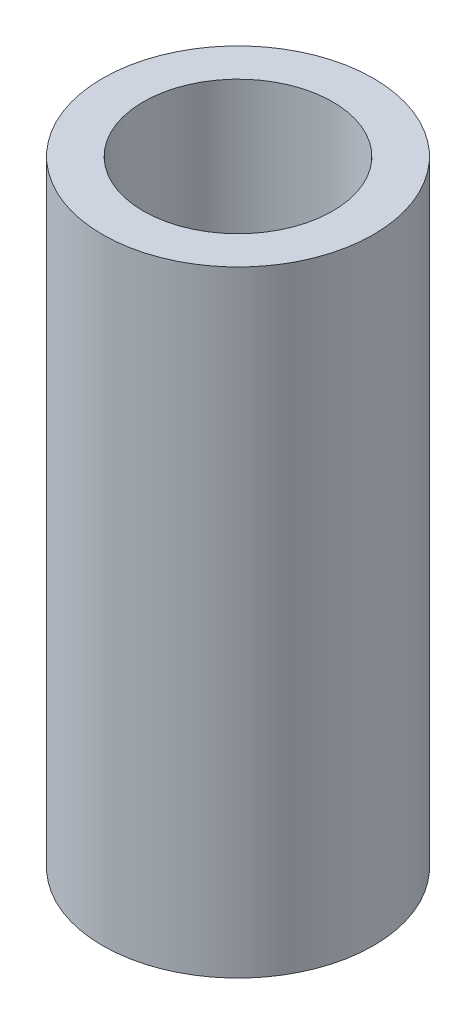
ISO-10303-21;
HEADER;
FILE_DESCRIPTION(('STEP AP214'),'2;1');
FILE_NAME('part.step','',(''),(''),'','','');
FILE_SCHEMA(('AUTOMOTIVE_DESIGN { 1 0 10303 214 1 1 1 1 }'));
ENDSEC;
DATA;
#1=APPLICATION_CONTEXT('core data for automotive mechanical design processes');
#2=APPLICATION_PROTOCOL_DEFINITION('international standard','automotive_design',2000,#1);
#3=PRODUCT_CONTEXT('',#1,'mechanical');
#4=PRODUCT('Part','Part','',(#3));
#5=PRODUCT_RELATED_PRODUCT_CATEGORY('part','',(#4));
#6=PRODUCT_DEFINITION_FORMATION('','',#4);
#7=PRODUCT_DEFINITION_CONTEXT('part definition',#1,'design');
#8=PRODUCT_DEFINITION('design','',#6,#7);
#9=PRODUCT_DEFINITION_SHAPE('','',#8);
#10=(LENGTH_UNIT() NAMED_UNIT(*) SI_UNIT(.MILLI.,.METRE.));
#11=(NAMED_UNIT(*) PLANE_ANGLE_UNIT() SI_UNIT($,.RADIAN.));
#12=(NAMED_UNIT(*) SI_UNIT($,.STERADIAN.) SOLID_ANGLE_UNIT());
#13=UNCERTAINTY_MEASURE_WITH_UNIT(LENGTH_MEASURE(1.E-05),#10,'distance_accuracy_value','');
#14=(GEOMETRIC_REPRESENTATION_CONTEXT(3) GLOBAL_UNCERTAINTY_ASSIGNED_CONTEXT((#13)) GLOBAL_UNIT_ASSIGNED_CONTEXT((#10,
#11,#12)) REPRESENTATION_CONTEXT('',''));
#15=CARTESIAN_POINT('',(0.,0.,0.));
#16=DIRECTION('',(0.,0.,1.));
#17=DIRECTION('',(1.,0.,0.));
#18=AXIS2_PLACEMENT_3D('',#15,#16,#17);
#19=CARTESIAN_POINT('',(0.,113.704206256395,0.));
#20=DIRECTION('',(0.,-1.,0.));
#21=DIRECTION('',(0.,0.,-1.));
#22=AXIS2_PLACEMENT_3D('',#19,#20,#21);
#23=CYLINDRICAL_SURFACE('',#22,25.);
#24=CARTESIAN_POINT('',(0.,113.704206256395,0.));
#25=DIRECTION('',(0.,1.,0.));
#26=DIRECTION('',(0.,0.,1.));
#27=AXIS2_PLACEMENT_3D('',#24,#25,#26);
#28=CIRCLE('',#27,25.);
#29=CARTESIAN_POINT('',(0.,113.704206256395,25.));
#30=VERTEX_POINT('',#29);
#31=EDGE_CURVE('E10',#30,#30,#28,.T.);
#32=ORIENTED_EDGE('',*,*,#31,.F.);
#33=EDGE_LOOP('',(#32));
#34=FACE_BOUND('',#33,.T.);
#35=CARTESIAN_POINT('',(0.,0.,0.));
#36=DIRECTION('',(0.,1.,0.));
#37=DIRECTION('',(0.,0.,1.));
#38=AXIS2_PLACEMENT_3D('',#35,#36,#37);
#39=CIRCLE('',#38,25.);
#40=CARTESIAN_POINT('',(0.,0.,25.));
#41=VERTEX_POINT('',#40);
#42=EDGE_CURVE('E37',#41,#41,#39,.T.);
#43=ORIENTED_EDGE('',*,*,#42,.T.);
#44=EDGE_LOOP('',(#43));
#45=FACE_BOUND('',#44,.T.);
#46=ADVANCED_FACE('F40',(#34,#45),#23,.T.);
#47=CARTESIAN_POINT('',(0.,113.704206256395,0.));
#48=DIRECTION('',(0.,1.,0.));
#49=DIRECTION('',(0.,0.,1.));
#50=AXIS2_PLACEMENT_3D('',#47,#48,#49);
#51=PLANE('',#50);
#52=CARTESIAN_POINT('',(0.,113.704206256395,0.));
#53=DIRECTION('',(0.,1.,0.));
#54=DIRECTION('',(0.,0.,1.));
#55=AXIS2_PLACEMENT_3D('',#52,#53,#54);
#56=CIRCLE('',#55,17.4836460957266);
#57=CARTESIAN_POINT('',(0.,113.704206256395,17.4836460957266));
#58=VERTEX_POINT('',#57);
#59=EDGE_CURVE('E50',#58,#58,#56,.T.);
#60=ORIENTED_EDGE('',*,*,#59,.F.);
#61=EDGE_LOOP('',(#60));
#62=FACE_BOUND('',#61,.T.);
#63=ORIENTED_EDGE('',*,*,#31,.T.);
#64=EDGE_LOOP('',(#63));
#65=FACE_BOUND('',#64,.T.);
#66=ADVANCED_FACE('F59',(#62,#65),#51,.T.);
#67=CARTESIAN_POINT('',(0.,0.,0.));
#68=DIRECTION('',(0.,1.,0.));
#69=DIRECTION('',(0.,0.,1.));
#70=AXIS2_PLACEMENT_3D('',#67,#68,#69);
#71=PLANE('',#70);
#72=CARTESIAN_POINT('',(0.,0.,0.));
#73=DIRECTION('',(0.,1.,0.));
#74=DIRECTION('',(0.,0.,1.));
#75=AXIS2_PLACEMENT_3D('',#72,#73,#74);
#76=CIRCLE('',#75,17.4836460957266);
#77=CARTESIAN_POINT('',(0.,0.,17.4836460957266));
#78=VERTEX_POINT('',#77);
#79=EDGE_CURVE('E47',#78,#78,#76,.T.);
#80=ORIENTED_EDGE('',*,*,#79,.T.);
#81=EDGE_LOOP('',(#80));
#82=FACE_BOUND('',#81,.T.);
#83=ORIENTED_EDGE('',*,*,#42,.F.);
#84=EDGE_LOOP('',(#83));
#85=FACE_BOUND('',#84,.T.);
#86=ADVANCED_FACE('F58',(#82,#85),#71,.F.);
#87=CARTESIAN_POINT('',(0.,113.704206256395,0.));
#88=DIRECTION('',(0.,-1.,0.));
#89=DIRECTION('',(0.,0.,-1.));
#90=AXIS2_PLACEMENT_3D('',#87,#88,#89);
#91=CYLINDRICAL_SURFACE('',#90,17.4836460957266);
#92=ORIENTED_EDGE('',*,*,#59,.T.);
#93=EDGE_LOOP('',(#92));
#94=FACE_BOUND('',#93,.T.);
#95=ORIENTED_EDGE('',*,*,#79,.F.);
#96=EDGE_LOOP('',(#95));
#97=FACE_BOUND('',#96,.T.);
#98=ADVANCED_FACE('F54',(#94,#97),#91,.F.);
#99=CLOSED_SHELL('',(#46,#66,#86,#98));
#100=MANIFOLD_SOLID_BREP('B2',#99);
#101=ADVANCED_BREP_SHAPE_REPRESENTATION('',(#18,#100),#14);
#102=SHAPE_DEFINITION_REPRESENTATION(#9,#101);
ENDSEC;
END-ISO-10303-21;
